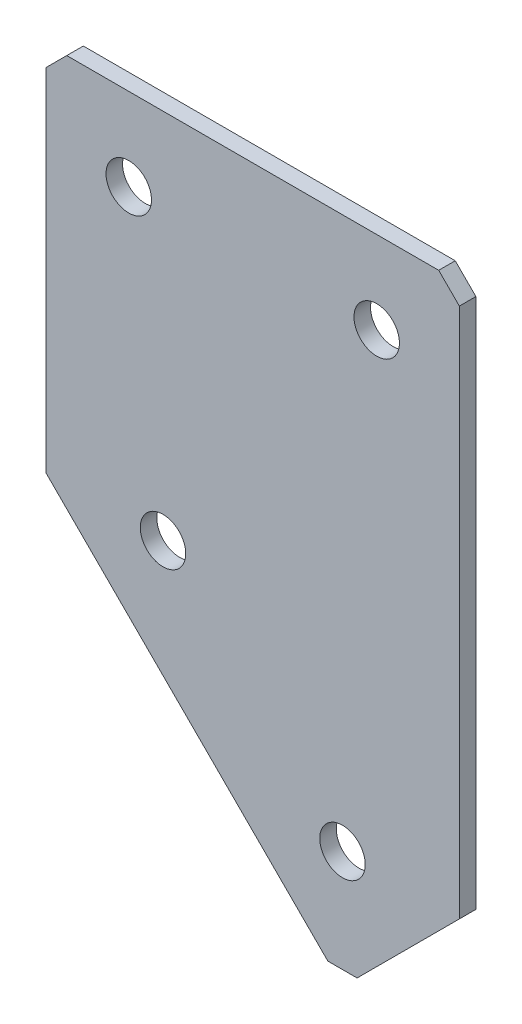
ISO-10303-21;
HEADER;
FILE_DESCRIPTION(('STEP AP214'),'2;1');
FILE_NAME('part.step','',(''),(''),'','','');
FILE_SCHEMA(('AUTOMOTIVE_DESIGN { 1 0 10303 214 1 1 1 1 }'));
ENDSEC;
DATA;
#1=APPLICATION_CONTEXT('core data for automotive mechanical design processes');
#2=APPLICATION_PROTOCOL_DEFINITION('international standard','automotive_design',2000,#1);
#3=PRODUCT_CONTEXT('',#1,'mechanical');
#4=PRODUCT('Part','Part','',(#3));
#5=PRODUCT_RELATED_PRODUCT_CATEGORY('part','',(#4));
#6=PRODUCT_DEFINITION_FORMATION('','',#4);
#7=PRODUCT_DEFINITION_CONTEXT('part definition',#1,'design');
#8=PRODUCT_DEFINITION('design','',#6,#7);
#9=PRODUCT_DEFINITION_SHAPE('','',#8);
#10=(LENGTH_UNIT() NAMED_UNIT(*) SI_UNIT(.MILLI.,.METRE.));
#11=(NAMED_UNIT(*) PLANE_ANGLE_UNIT() SI_UNIT($,.RADIAN.));
#12=(NAMED_UNIT(*) SI_UNIT($,.STERADIAN.) SOLID_ANGLE_UNIT());
#13=UNCERTAINTY_MEASURE_WITH_UNIT(LENGTH_MEASURE(1.E-05),#10,'distance_accuracy_value','');
#14=(GEOMETRIC_REPRESENTATION_CONTEXT(3) GLOBAL_UNCERTAINTY_ASSIGNED_CONTEXT((#13)) GLOBAL_UNIT_ASSIGNED_CONTEXT((#10,
#11,#12)) REPRESENTATION_CONTEXT('',''));
#15=CARTESIAN_POINT('',(0.,0.,0.));
#16=DIRECTION('',(0.,0.,1.));
#17=DIRECTION('',(1.,0.,0.));
#18=AXIS2_PLACEMENT_3D('',#15,#16,#17);
#19=CARTESIAN_POINT('',(0.,0.,-2.));
#20=DIRECTION('',(1.,0.,0.));
#21=DIRECTION('',(0.,0.,-1.));
#22=AXIS2_PLACEMENT_3D('',#19,#20,#21);
#23=PLANE('',#22);
#24=DIRECTION('',(0.,1.,0.));
#25=VECTOR('',#24,1.);
#26=CARTESIAN_POINT('',(0.,0.,0.));
#27=LINE('',#26,#25);
#28=CARTESIAN_POINT('',(0.,-45.,0.));
#29=VERTEX_POINT('',#28);
#30=CARTESIAN_POINT('',(0.,-2.50000000000002,0.));
#31=VERTEX_POINT('',#30);
#32=EDGE_CURVE('E130',#29,#31,#27,.T.);
#33=ORIENTED_EDGE('',*,*,#32,.T.);
#34=DIRECTION('',(0.,0.,-1.));
#35=VECTOR('',#34,1.);
#36=CARTESIAN_POINT('',(0.,-2.50000000000002,-2.));
#37=LINE('',#36,#35);
#38=CARTESIAN_POINT('',(0.,-2.50000000000002,-2.));
#39=VERTEX_POINT('',#38);
#40=EDGE_CURVE('E11',#31,#39,#37,.T.);
#41=ORIENTED_EDGE('',*,*,#40,.T.);
#42=DIRECTION('',(0.,1.,0.));
#43=VECTOR('',#42,1.);
#44=CARTESIAN_POINT('',(0.,0.,-2.));
#45=LINE('',#44,#43);
#46=CARTESIAN_POINT('',(0.,-45.,-2.));
#47=VERTEX_POINT('',#46);
#48=EDGE_CURVE('E141',#47,#39,#45,.T.);
#49=ORIENTED_EDGE('',*,*,#48,.F.);
#50=DIRECTION('',(0.,0.,1.));
#51=VECTOR('',#50,1.);
#52=CARTESIAN_POINT('',(0.,-45.,-2.));
#53=LINE('',#52,#51);
#54=EDGE_CURVE('E120',#47,#29,#53,.T.);
#55=ORIENTED_EDGE('',*,*,#54,.T.);
#56=EDGE_LOOP('',(#33,#41,#49,#55));
#57=FACE_BOUND('',#56,.T.);
#58=ADVANCED_FACE('F37',(#57),#23,.F.);
#59=CARTESIAN_POINT('',(0.,0.,-2.));
#60=DIRECTION('',(0.,-1.,0.));
#61=DIRECTION('',(0.,0.,-1.));
#62=AXIS2_PLACEMENT_3D('',#59,#60,#61);
#63=PLANE('',#62);
#64=DIRECTION('',(1.,0.,0.));
#65=VECTOR('',#64,1.);
#66=CARTESIAN_POINT('',(0.,0.,0.));
#67=LINE('',#66,#65);
#68=CARTESIAN_POINT('',(2.50000000000002,0.,0.));
#69=VERTEX_POINT('',#68);
#70=CARTESIAN_POINT('',(47.5,0.,0.));
#71=VERTEX_POINT('',#70);
#72=EDGE_CURVE('E133',#69,#71,#67,.T.);
#73=ORIENTED_EDGE('',*,*,#72,.T.);
#74=DIRECTION('',(0.,0.,-1.));
#75=VECTOR('',#74,1.);
#76=CARTESIAN_POINT('',(47.5,0.,-2.));
#77=LINE('',#76,#75);
#78=CARTESIAN_POINT('',(47.5,0.,-2.));
#79=VERTEX_POINT('',#78);
#80=EDGE_CURVE('E45',#71,#79,#77,.T.);
#81=ORIENTED_EDGE('',*,*,#80,.T.);
#82=DIRECTION('',(1.,0.,0.));
#83=VECTOR('',#82,1.);
#84=CARTESIAN_POINT('',(0.,0.,-2.));
#85=LINE('',#84,#83);
#86=CARTESIAN_POINT('',(2.50000000000002,0.,-2.));
#87=VERTEX_POINT('',#86);
#88=EDGE_CURVE('E109',#87,#79,#85,.T.);
#89=ORIENTED_EDGE('',*,*,#88,.F.);
#90=DIRECTION('',(0.,0.,1.));
#91=VECTOR('',#90,1.);
#92=CARTESIAN_POINT('',(2.50000000000002,0.,-2.));
#93=LINE('',#92,#91);
#94=EDGE_CURVE('E160',#87,#69,#93,.T.);
#95=ORIENTED_EDGE('',*,*,#94,.T.);
#96=EDGE_LOOP('',(#73,#81,#89,#95));
#97=FACE_BOUND('',#96,.T.);
#98=ADVANCED_FACE('F164',(#97),#63,.F.);
#99=CARTESIAN_POINT('',(50.,0.,-2.));
#100=DIRECTION('',(-1.,0.,0.));
#101=DIRECTION('',(0.,0.,1.));
#102=AXIS2_PLACEMENT_3D('',#99,#100,#101);
#103=PLANE('',#102);
#104=DIRECTION('',(0.,-1.,0.));
#105=VECTOR('',#104,1.);
#106=CARTESIAN_POINT('',(50.,0.,-2.));
#107=LINE('',#106,#105);
#108=CARTESIAN_POINT('',(50.,-2.50000000000002,-2.));
#109=VERTEX_POINT('',#108);
#110=CARTESIAN_POINT('',(50.,-66.7157287525382,-2.));
#111=VERTEX_POINT('',#110);
#112=EDGE_CURVE('E100',#109,#111,#107,.T.);
#113=ORIENTED_EDGE('',*,*,#112,.F.);
#114=DIRECTION('',(0.,0.,1.));
#115=VECTOR('',#114,1.);
#116=CARTESIAN_POINT('',(50.,-2.50000000000002,-2.));
#117=LINE('',#116,#115);
#118=CARTESIAN_POINT('',(50.,-2.50000000000002,0.));
#119=VERTEX_POINT('',#118);
#120=EDGE_CURVE('E158',#109,#119,#117,.T.);
#121=ORIENTED_EDGE('',*,*,#120,.T.);
#122=DIRECTION('',(0.,-1.,0.));
#123=VECTOR('',#122,1.);
#124=CARTESIAN_POINT('',(50.,0.,0.));
#125=LINE('',#124,#123);
#126=CARTESIAN_POINT('',(50.,-66.7157287525382,0.));
#127=VERTEX_POINT('',#126);
#128=EDGE_CURVE('E115',#119,#127,#125,.T.);
#129=ORIENTED_EDGE('',*,*,#128,.T.);
#130=DIRECTION('',(0.,0.,1.));
#131=VECTOR('',#130,1.);
#132=CARTESIAN_POINT('',(50.,-66.7157287525382,-2.));
#133=LINE('',#132,#131);
#134=EDGE_CURVE('E112',#111,#127,#133,.T.);
#135=ORIENTED_EDGE('',*,*,#134,.F.);
#136=EDGE_LOOP('',(#113,#121,#129,#135));
#137=FACE_BOUND('',#136,.T.);
#138=ADVANCED_FACE('F113',(#137),#103,.F.);
#139=CARTESIAN_POINT('',(35.857864376269,-80.8578643762692,-2.));
#140=DIRECTION('',(-0.707106781186547,0.707106781186549,0.));
#141=DIRECTION('',(-0.707106781186549,-0.707106781186547,0.));
#142=AXIS2_PLACEMENT_3D('',#139,#140,#141);
#143=PLANE('',#142);
#144=DIRECTION('',(-0.707106781186548,-0.707106781186547,0.));
#145=VECTOR('',#144,1.);
#146=CARTESIAN_POINT('',(35.857864376269,-80.8578643762692,0.));
#147=LINE('',#146,#145);
#148=CARTESIAN_POINT('',(37.6256313292354,-79.0900974233028,0.));
#149=VERTEX_POINT('',#148);
#150=EDGE_CURVE('E137',#127,#149,#147,.T.);
#151=ORIENTED_EDGE('',*,*,#150,.T.);
#152=DIRECTION('',(0.,0.,-1.));
#153=VECTOR('',#152,1.);
#154=CARTESIAN_POINT('',(37.6256313292354,-79.0900974233028,-2.));
#155=LINE('',#154,#153);
#156=CARTESIAN_POINT('',(37.6256313292354,-79.0900974233028,-2.));
#157=VERTEX_POINT('',#156);
#158=EDGE_CURVE('E124',#149,#157,#155,.T.);
#159=ORIENTED_EDGE('',*,*,#158,.T.);
#160=DIRECTION('',(-0.707106781186548,-0.707106781186547,0.));
#161=VECTOR('',#160,1.);
#162=CARTESIAN_POINT('',(35.857864376269,-80.8578643762692,-2.));
#163=LINE('',#162,#161);
#164=EDGE_CURVE('E104',#111,#157,#163,.T.);
#165=ORIENTED_EDGE('',*,*,#164,.F.);
#166=ORIENTED_EDGE('',*,*,#134,.T.);
#167=EDGE_LOOP('',(#151,#159,#165,#166));
#168=FACE_BOUND('',#167,.T.);
#169=ADVANCED_FACE('F122',(#168),#143,.F.);
#170=CARTESIAN_POINT('',(0.,-45.,-2.));
#171=DIRECTION('',(0.707106781186549,0.707106781186546,0.));
#172=DIRECTION('',(-0.707106781186546,0.707106781186549,0.));
#173=AXIS2_PLACEMENT_3D('',#170,#171,#172);
#174=PLANE('',#173);
#175=DIRECTION('',(-0.707106781186546,0.707106781186549,0.));
#176=VECTOR('',#175,1.);
#177=CARTESIAN_POINT('',(0.,-45.,-2.));
#178=LINE('',#177,#176);
#179=CARTESIAN_POINT('',(34.0900974233027,-79.0900974233028,-2.));
#180=VERTEX_POINT('',#179);
#181=EDGE_CURVE('E125',#180,#47,#178,.T.);
#182=ORIENTED_EDGE('',*,*,#181,.F.);
#183=DIRECTION('',(0.,0.,1.));
#184=VECTOR('',#183,1.);
#185=CARTESIAN_POINT('',(34.0900974233027,-79.0900974233028,-2.));
#186=LINE('',#185,#184);
#187=CARTESIAN_POINT('',(34.0900974233027,-79.0900974233028,0.));
#188=VERTEX_POINT('',#187);
#189=EDGE_CURVE('E119',#180,#188,#186,.T.);
#190=ORIENTED_EDGE('',*,*,#189,.T.);
#191=DIRECTION('',(-0.707106781186546,0.707106781186549,0.));
#192=VECTOR('',#191,1.);
#193=CARTESIAN_POINT('',(0.,-45.,0.));
#194=LINE('',#193,#192);
#195=EDGE_CURVE('E139',#188,#29,#194,.T.);
#196=ORIENTED_EDGE('',*,*,#195,.T.);
#197=ORIENTED_EDGE('',*,*,#54,.F.);
#198=EDGE_LOOP('',(#182,#190,#196,#197));
#199=FACE_BOUND('',#198,.T.);
#200=ADVANCED_FACE('F194',(#199),#174,.F.);
#201=CARTESIAN_POINT('',(0.,0.,-2.));
#202=DIRECTION('',(0.,0.,1.));
#203=DIRECTION('',(1.,0.,0.));
#204=AXIS2_PLACEMENT_3D('',#201,#202,#203);
#205=PLANE('',#204);
#206=CARTESIAN_POINT('',(10.,-10.,-2.));
#207=DIRECTION('',(0.,0.,-1.));
#208=DIRECTION('',(0.,1.,0.));
#209=AXIS2_PLACEMENT_3D('',#206,#207,#208);
#210=CIRCLE('',#209,2.75);
#211=CARTESIAN_POINT('',(10.,-7.25,-2.));
#212=VERTEX_POINT('',#211);
#213=EDGE_CURVE('E226',#212,#212,#210,.T.);
#214=ORIENTED_EDGE('',*,*,#213,.F.);
#215=EDGE_LOOP('',(#214));
#216=FACE_BOUND('',#215,.T.);
#217=CARTESIAN_POINT('',(40.,-10.,-2.));
#218=DIRECTION('',(0.,0.,-1.));
#219=DIRECTION('',(0.,1.,0.));
#220=AXIS2_PLACEMENT_3D('',#217,#218,#219);
#221=CIRCLE('',#220,2.75);
#222=CARTESIAN_POINT('',(40.,-7.25,-2.));
#223=VERTEX_POINT('',#222);
#224=EDGE_CURVE('E228',#223,#223,#221,.T.);
#225=ORIENTED_EDGE('',*,*,#224,.F.);
#226=EDGE_LOOP('',(#225));
#227=FACE_BOUND('',#226,.T.);
#228=CARTESIAN_POINT('',(14.1421356237309,-45.0000000000001,-2.));
#229=DIRECTION('',(0.,0.,-1.));
#230=DIRECTION('',(0.,1.,0.));
#231=AXIS2_PLACEMENT_3D('',#228,#229,#230);
#232=CIRCLE('',#231,2.75);
#233=CARTESIAN_POINT('',(14.1421356237309,-42.2500000000001,-2.));
#234=VERTEX_POINT('',#233);
#235=EDGE_CURVE('E236',#234,#234,#232,.T.);
#236=ORIENTED_EDGE('',*,*,#235,.F.);
#237=EDGE_LOOP('',(#236));
#238=FACE_BOUND('',#237,.T.);
#239=CARTESIAN_POINT('',(35.8578643762691,-66.7157287525382,-2.));
#240=DIRECTION('',(0.,0.,-1.));
#241=DIRECTION('',(0.,1.,0.));
#242=AXIS2_PLACEMENT_3D('',#239,#240,#241);
#243=CIRCLE('',#242,2.75);
#244=CARTESIAN_POINT('',(35.8578643762691,-63.9657287525382,-2.));
#245=VERTEX_POINT('',#244);
#246=EDGE_CURVE('E242',#245,#245,#243,.T.);
#247=ORIENTED_EDGE('',*,*,#246,.F.);
#248=EDGE_LOOP('',(#247));
#249=FACE_BOUND('',#248,.T.);
#250=ORIENTED_EDGE('',*,*,#164,.T.);
#251=DIRECTION('',(1.,0.,0.));
#252=VECTOR('',#251,1.);
#253=CARTESIAN_POINT('',(34.0900974233027,-79.0900974233028,-2.));
#254=LINE('',#253,#252);
#255=EDGE_CURVE('E156',#157,#180,#254,.F.);
#256=ORIENTED_EDGE('',*,*,#255,.T.);
#257=ORIENTED_EDGE('',*,*,#181,.T.);
#258=ORIENTED_EDGE('',*,*,#48,.T.);
#259=DIRECTION('',(-0.707106781186548,-0.707106781186548,0.));
#260=VECTOR('',#259,1.);
#261=CARTESIAN_POINT('',(2.50000000000002,0.,-2.));
#262=LINE('',#261,#260);
#263=EDGE_CURVE('E153',#39,#87,#262,.F.);
#264=ORIENTED_EDGE('',*,*,#263,.T.);
#265=ORIENTED_EDGE('',*,*,#88,.T.);
#266=DIRECTION('',(-0.707106781186548,0.707106781186548,0.));
#267=VECTOR('',#266,1.);
#268=CARTESIAN_POINT('',(50.,-2.50000000000002,-2.));
#269=LINE('',#268,#267);
#270=EDGE_CURVE('E52',#79,#109,#269,.F.);
#271=ORIENTED_EDGE('',*,*,#270,.T.);
#272=ORIENTED_EDGE('',*,*,#112,.T.);
#273=EDGE_LOOP('',(#250,#256,#257,#258,#264,#265,#271,#272));
#274=FACE_BOUND('',#273,.T.);
#275=ADVANCED_FACE('F102',(#216,#227,#238,#249,#274),#205,.F.);
#276=CARTESIAN_POINT('',(0.,0.,0.));
#277=DIRECTION('',(0.,0.,1.));
#278=DIRECTION('',(1.,0.,0.));
#279=AXIS2_PLACEMENT_3D('',#276,#277,#278);
#280=PLANE('',#279);
#281=CARTESIAN_POINT('',(10.,-10.,0.));
#282=DIRECTION('',(0.,0.,-1.));
#283=DIRECTION('',(0.,1.,0.));
#284=AXIS2_PLACEMENT_3D('',#281,#282,#283);
#285=CIRCLE('',#284,2.75);
#286=CARTESIAN_POINT('',(10.,-7.25,0.));
#287=VERTEX_POINT('',#286);
#288=EDGE_CURVE('E223',#287,#287,#285,.T.);
#289=ORIENTED_EDGE('',*,*,#288,.T.);
#290=EDGE_LOOP('',(#289));
#291=FACE_BOUND('',#290,.T.);
#292=CARTESIAN_POINT('',(40.,-10.,0.));
#293=DIRECTION('',(0.,0.,-1.));
#294=DIRECTION('',(0.,1.,0.));
#295=AXIS2_PLACEMENT_3D('',#292,#293,#294);
#296=CIRCLE('',#295,2.75);
#297=CARTESIAN_POINT('',(40.,-7.25,0.));
#298=VERTEX_POINT('',#297);
#299=EDGE_CURVE('E233',#298,#298,#296,.T.);
#300=ORIENTED_EDGE('',*,*,#299,.T.);
#301=EDGE_LOOP('',(#300));
#302=FACE_BOUND('',#301,.T.);
#303=CARTESIAN_POINT('',(14.1421356237309,-45.0000000000001,0.));
#304=DIRECTION('',(0.,0.,-1.));
#305=DIRECTION('',(0.,1.,0.));
#306=AXIS2_PLACEMENT_3D('',#303,#304,#305);
#307=CIRCLE('',#306,2.75);
#308=CARTESIAN_POINT('',(14.1421356237309,-42.2500000000001,0.));
#309=VERTEX_POINT('',#308);
#310=EDGE_CURVE('E239',#309,#309,#307,.T.);
#311=ORIENTED_EDGE('',*,*,#310,.T.);
#312=EDGE_LOOP('',(#311));
#313=FACE_BOUND('',#312,.T.);
#314=CARTESIAN_POINT('',(35.8578643762691,-66.7157287525382,0.));
#315=DIRECTION('',(0.,0.,-1.));
#316=DIRECTION('',(0.,1.,0.));
#317=AXIS2_PLACEMENT_3D('',#314,#315,#316);
#318=CIRCLE('',#317,2.75);
#319=CARTESIAN_POINT('',(35.8578643762691,-63.9657287525382,0.));
#320=VERTEX_POINT('',#319);
#321=EDGE_CURVE('E134',#320,#320,#318,.T.);
#322=ORIENTED_EDGE('',*,*,#321,.T.);
#323=EDGE_LOOP('',(#322));
#324=FACE_BOUND('',#323,.T.);
#325=ORIENTED_EDGE('',*,*,#195,.F.);
#326=DIRECTION('',(-1.,0.,0.));
#327=VECTOR('',#326,1.);
#328=CARTESIAN_POINT('',(0.,-79.0900974233028,0.));
#329=LINE('',#328,#327);
#330=EDGE_CURVE('E150',#188,#149,#329,.F.);
#331=ORIENTED_EDGE('',*,*,#330,.T.);
#332=ORIENTED_EDGE('',*,*,#150,.F.);
#333=ORIENTED_EDGE('',*,*,#128,.F.);
#334=DIRECTION('',(0.707106781186548,-0.707106781186548,0.));
#335=VECTOR('',#334,1.);
#336=CARTESIAN_POINT('',(23.75,23.75,0.));
#337=LINE('',#336,#335);
#338=EDGE_CURVE('E148',#119,#71,#337,.F.);
#339=ORIENTED_EDGE('',*,*,#338,.T.);
#340=ORIENTED_EDGE('',*,*,#72,.F.);
#341=DIRECTION('',(0.707106781186548,0.707106781186548,0.));
#342=VECTOR('',#341,1.);
#343=CARTESIAN_POINT('',(1.25000000000001,-1.25000000000001,0.));
#344=LINE('',#343,#342);
#345=EDGE_CURVE('E146',#69,#31,#344,.F.);
#346=ORIENTED_EDGE('',*,*,#345,.T.);
#347=ORIENTED_EDGE('',*,*,#32,.F.);
#348=EDGE_LOOP('',(#325,#331,#332,#333,#339,#340,#346,#347));
#349=FACE_BOUND('',#348,.T.);
#350=ADVANCED_FACE('F169',(#291,#302,#313,#324,#349),#280,.T.);
#351=CARTESIAN_POINT('',(35.8578643762691,-66.7157287525382,-2.));
#352=DIRECTION('',(0.,0.,-1.));
#353=DIRECTION('',(0.,1.,0.));
#354=AXIS2_PLACEMENT_3D('',#351,#352,#353);
#355=CYLINDRICAL_SURFACE('',#354,2.75);
#356=ORIENTED_EDGE('',*,*,#321,.F.);
#357=EDGE_LOOP('',(#356));
#358=FACE_BOUND('',#357,.T.);
#359=ORIENTED_EDGE('',*,*,#246,.T.);
#360=EDGE_LOOP('',(#359));
#361=FACE_BOUND('',#360,.T.);
#362=ADVANCED_FACE('F200',(#358,#361),#355,.F.);
#363=CARTESIAN_POINT('',(14.1421356237309,-45.0000000000001,-2.));
#364=DIRECTION('',(0.,0.,-1.));
#365=DIRECTION('',(0.,1.,0.));
#366=AXIS2_PLACEMENT_3D('',#363,#364,#365);
#367=CYLINDRICAL_SURFACE('',#366,2.75);
#368=ORIENTED_EDGE('',*,*,#310,.F.);
#369=EDGE_LOOP('',(#368));
#370=FACE_BOUND('',#369,.T.);
#371=ORIENTED_EDGE('',*,*,#235,.T.);
#372=EDGE_LOOP('',(#371));
#373=FACE_BOUND('',#372,.T.);
#374=ADVANCED_FACE('F207',(#370,#373),#367,.F.);
#375=CARTESIAN_POINT('',(40.,-10.,-2.));
#376=DIRECTION('',(0.,0.,-1.));
#377=DIRECTION('',(0.,1.,0.));
#378=AXIS2_PLACEMENT_3D('',#375,#376,#377);
#379=CYLINDRICAL_SURFACE('',#378,2.75);
#380=ORIENTED_EDGE('',*,*,#299,.F.);
#381=EDGE_LOOP('',(#380));
#382=FACE_BOUND('',#381,.T.);
#383=ORIENTED_EDGE('',*,*,#224,.T.);
#384=EDGE_LOOP('',(#383));
#385=FACE_BOUND('',#384,.T.);
#386=ADVANCED_FACE('F211',(#382,#385),#379,.F.);
#387=CARTESIAN_POINT('',(10.,-10.,-2.));
#388=DIRECTION('',(0.,0.,-1.));
#389=DIRECTION('',(0.,1.,0.));
#390=AXIS2_PLACEMENT_3D('',#387,#388,#389);
#391=CYLINDRICAL_SURFACE('',#390,2.75);
#392=ORIENTED_EDGE('',*,*,#288,.F.);
#393=EDGE_LOOP('',(#392));
#394=FACE_BOUND('',#393,.T.);
#395=ORIENTED_EDGE('',*,*,#213,.T.);
#396=EDGE_LOOP('',(#395));
#397=FACE_BOUND('',#396,.T.);
#398=ADVANCED_FACE('F179',(#394,#397),#391,.F.);
#399=CARTESIAN_POINT('',(34.0900974233027,-79.0900974233028,-2.));
#400=DIRECTION('',(0.,1.,0.));
#401=DIRECTION('',(0.,0.,1.));
#402=AXIS2_PLACEMENT_3D('',#399,#400,#401);
#403=PLANE('',#402);
#404=ORIENTED_EDGE('',*,*,#255,.F.);
#405=ORIENTED_EDGE('',*,*,#158,.F.);
#406=ORIENTED_EDGE('',*,*,#330,.F.);
#407=ORIENTED_EDGE('',*,*,#189,.F.);
#408=EDGE_LOOP('',(#404,#405,#406,#407));
#409=FACE_BOUND('',#408,.T.);
#410=ADVANCED_FACE('F174',(#409),#403,.F.);
#411=CARTESIAN_POINT('',(50.,-2.50000000000002,-2.));
#412=DIRECTION('',(-0.707106781186547,-0.707106781186547,0.));
#413=DIRECTION('',(0.,0.,1.));
#414=AXIS2_PLACEMENT_3D('',#411,#412,#413);
#415=PLANE('',#414);
#416=ORIENTED_EDGE('',*,*,#270,.F.);
#417=ORIENTED_EDGE('',*,*,#80,.F.);
#418=ORIENTED_EDGE('',*,*,#338,.F.);
#419=ORIENTED_EDGE('',*,*,#120,.F.);
#420=EDGE_LOOP('',(#416,#417,#418,#419));
#421=FACE_BOUND('',#420,.T.);
#422=ADVANCED_FACE('F172',(#421),#415,.F.);
#423=CARTESIAN_POINT('',(2.50000000000002,0.,-2.));
#424=DIRECTION('',(0.707106781186547,-0.707106781186547,0.));
#425=DIRECTION('',(0.,0.,1.));
#426=AXIS2_PLACEMENT_3D('',#423,#424,#425);
#427=PLANE('',#426);
#428=ORIENTED_EDGE('',*,*,#263,.F.);
#429=ORIENTED_EDGE('',*,*,#40,.F.);
#430=ORIENTED_EDGE('',*,*,#345,.F.);
#431=ORIENTED_EDGE('',*,*,#94,.F.);
#432=EDGE_LOOP('',(#428,#429,#430,#431));
#433=FACE_BOUND('',#432,.T.);
#434=ADVANCED_FACE('F39',(#433),#427,.F.);
#435=CLOSED_SHELL('',(#58,#98,#138,#169,#200,#275,#350,#362,#374,#386,#398,#410,#422,#434));
#436=MANIFOLD_SOLID_BREP('B2',#435);
#437=ADVANCED_BREP_SHAPE_REPRESENTATION('',(#18,#436),#14);
#438=SHAPE_DEFINITION_REPRESENTATION(#9,#437);
ENDSEC;
END-ISO-10303-21;
